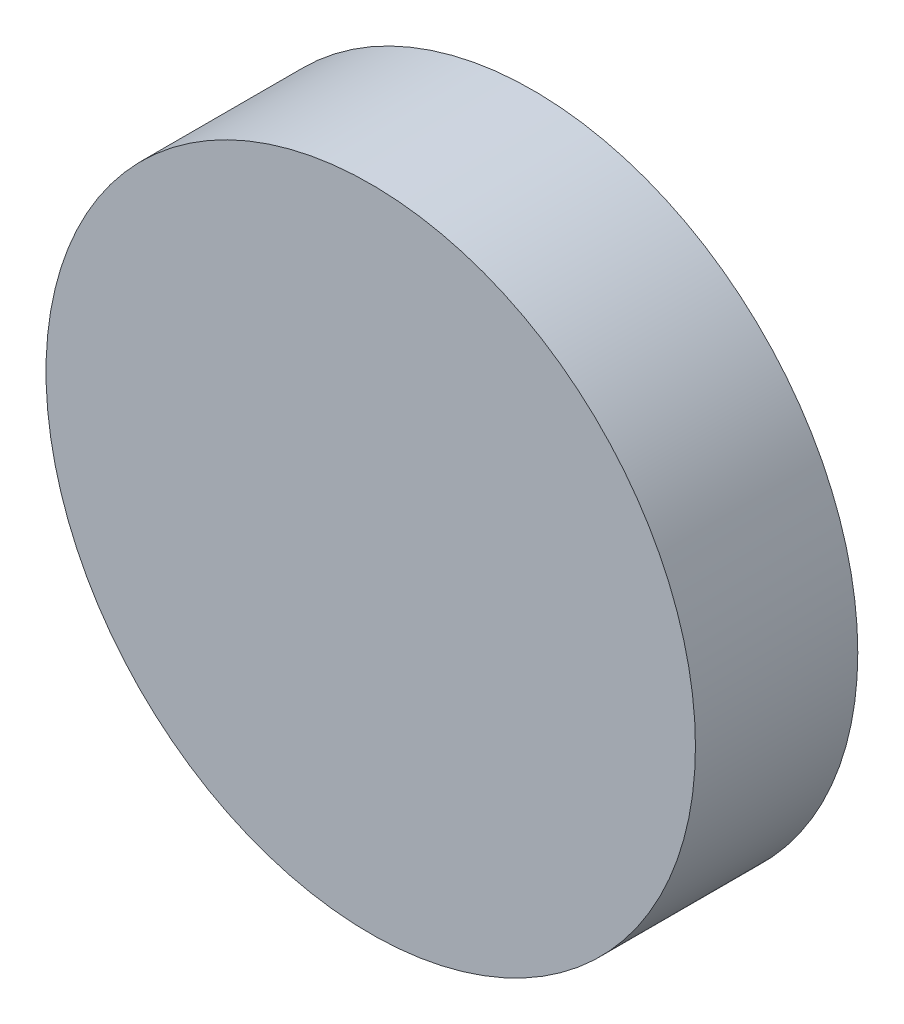
ISO-10303-21;
HEADER;
FILE_DESCRIPTION(('STEP AP214'),'2;1');
FILE_NAME('part.step','',(''),(''),'','','');
FILE_SCHEMA(('AUTOMOTIVE_DESIGN { 1 0 10303 214 1 1 1 1 }'));
ENDSEC;
DATA;
#1=APPLICATION_CONTEXT('core data for automotive mechanical design processes');
#2=APPLICATION_PROTOCOL_DEFINITION('international standard','automotive_design',2000,#1);
#3=PRODUCT_CONTEXT('',#1,'mechanical');
#4=PRODUCT('Part','Part','',(#3));
#5=PRODUCT_RELATED_PRODUCT_CATEGORY('part','',(#4));
#6=PRODUCT_DEFINITION_FORMATION('','',#4);
#7=PRODUCT_DEFINITION_CONTEXT('part definition',#1,'design');
#8=PRODUCT_DEFINITION('design','',#6,#7);
#9=PRODUCT_DEFINITION_SHAPE('','',#8);
#10=(LENGTH_UNIT() NAMED_UNIT(*) SI_UNIT(.MILLI.,.METRE.));
#11=(NAMED_UNIT(*) PLANE_ANGLE_UNIT() SI_UNIT($,.RADIAN.));
#12=(NAMED_UNIT(*) SI_UNIT($,.STERADIAN.) SOLID_ANGLE_UNIT());
#13=UNCERTAINTY_MEASURE_WITH_UNIT(LENGTH_MEASURE(1.E-05),#10,'distance_accuracy_value','');
#14=(GEOMETRIC_REPRESENTATION_CONTEXT(3) GLOBAL_UNCERTAINTY_ASSIGNED_CONTEXT((#13)) GLOBAL_UNIT_ASSIGNED_CONTEXT((#10,
#11,#12)) REPRESENTATION_CONTEXT('',''));
#15=CARTESIAN_POINT('',(0.,0.,0.));
#16=DIRECTION('',(0.,0.,1.));
#17=DIRECTION('',(1.,0.,0.));
#18=AXIS2_PLACEMENT_3D('',#15,#16,#17);
#19=CARTESIAN_POINT('',(0.,0.,5.));
#20=DIRECTION('',(0.,0.,-1.));
#21=DIRECTION('',(-1.00000000000001,0.,0.));
#22=AXIS2_PLACEMENT_3D('',#19,#20,#21);
#23=CYLINDRICAL_SURFACE('',#22,10.);
#24=CARTESIAN_POINT('',(0.,0.,5.));
#25=DIRECTION('',(0.,0.,1.));
#26=DIRECTION('',(1.00000000000001,0.,0.));
#27=AXIS2_PLACEMENT_3D('',#24,#25,#26);
#28=CIRCLE('',#27,10.);
#29=CARTESIAN_POINT('',(10.,0.,5.00000000000005));
#30=VERTEX_POINT('',#29);
#31=EDGE_CURVE('E12',#30,#30,#28,.T.);
#32=ORIENTED_EDGE('',*,*,#31,.F.);
#33=EDGE_LOOP('',(#32));
#34=FACE_BOUND('',#33,.T.);
#35=CARTESIAN_POINT('',(0.,0.,0.));
#36=DIRECTION('',(0.,0.,1.));
#37=DIRECTION('',(1.00000000000001,0.,0.));
#38=AXIS2_PLACEMENT_3D('',#35,#36,#37);
#39=CIRCLE('',#38,10.);
#40=CARTESIAN_POINT('',(10.0000000000001,0.,0.));
#41=VERTEX_POINT('',#40);
#42=EDGE_CURVE('E41',#41,#41,#39,.T.);
#43=ORIENTED_EDGE('',*,*,#42,.T.);
#44=EDGE_LOOP('',(#43));
#45=FACE_BOUND('',#44,.T.);
#46=ADVANCED_FACE('F38',(#34,#45),#23,.T.);
#47=CARTESIAN_POINT('',(0.,0.,5.));
#48=DIRECTION('',(0.,0.,1.));
#49=DIRECTION('',(1.00000000000001,0.,0.));
#50=AXIS2_PLACEMENT_3D('',#47,#48,#49);
#51=PLANE('',#50);
#52=ORIENTED_EDGE('',*,*,#31,.T.);
#53=EDGE_LOOP('',(#52));
#54=FACE_BOUND('',#53,.T.);
#55=ADVANCED_FACE('F53',(#54),#51,.T.);
#56=CARTESIAN_POINT('',(0.,0.,0.));
#57=DIRECTION('',(0.,0.,1.));
#58=DIRECTION('',(1.00000000000001,0.,0.));
#59=AXIS2_PLACEMENT_3D('',#56,#57,#58);
#60=PLANE('',#59);
#61=ORIENTED_EDGE('',*,*,#42,.F.);
#62=EDGE_LOOP('',(#61));
#63=FACE_BOUND('',#62,.T.);
#64=ADVANCED_FACE('F51',(#63),#60,.F.);
#65=CLOSED_SHELL('',(#46,#55,#64));
#66=MANIFOLD_SOLID_BREP('B2',#65);
#67=ADVANCED_BREP_SHAPE_REPRESENTATION('',(#18,#66),#14);
#68=SHAPE_DEFINITION_REPRESENTATION(#9,#67);
ENDSEC;
END-ISO-10303-21;
